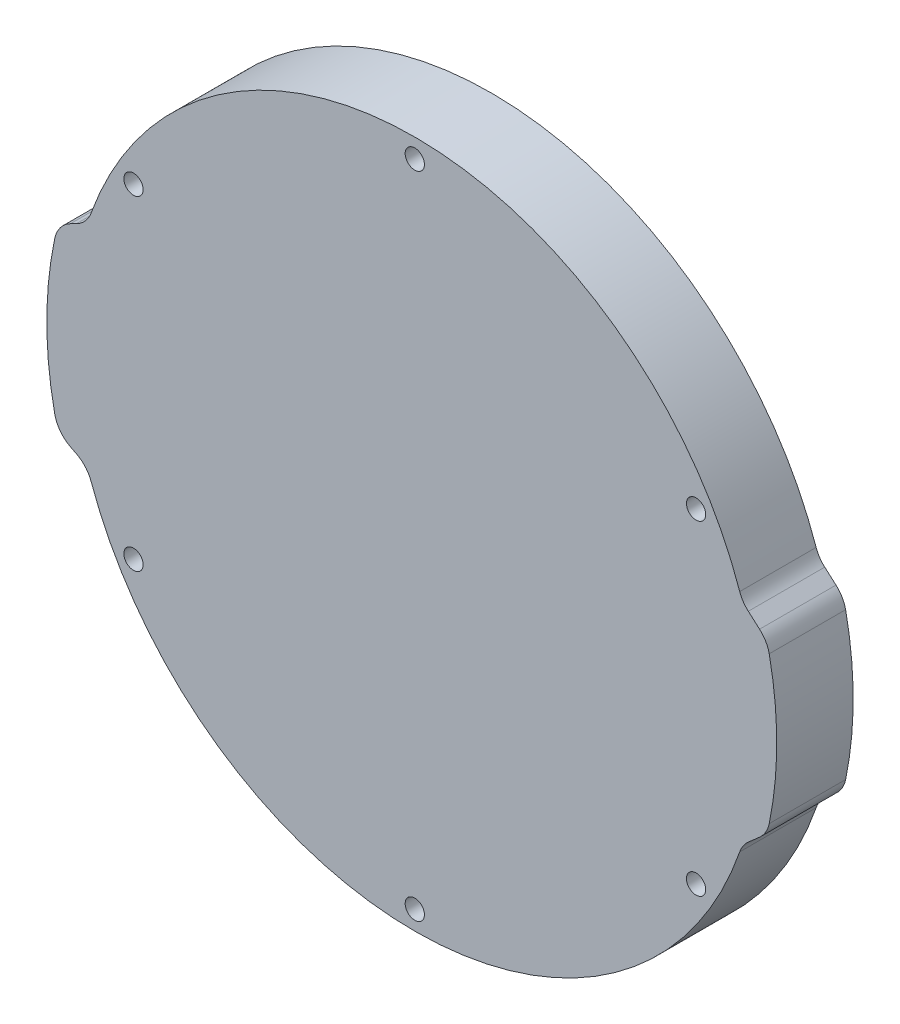
ISO-10303-21;
HEADER;
FILE_DESCRIPTION(('STEP AP214'),'2;1');
FILE_NAME('part.step','',(''),(''),'','','');
FILE_SCHEMA(('AUTOMOTIVE_DESIGN { 1 0 10303 214 1 1 1 1 }'));
ENDSEC;
DATA;
#1=APPLICATION_CONTEXT('core data for automotive mechanical design processes');
#2=APPLICATION_PROTOCOL_DEFINITION('international standard','automotive_design',2000,#1);
#3=PRODUCT_CONTEXT('',#1,'mechanical');
#4=PRODUCT('Part','Part','',(#3));
#5=PRODUCT_RELATED_PRODUCT_CATEGORY('part','',(#4));
#6=PRODUCT_DEFINITION_FORMATION('','',#4);
#7=PRODUCT_DEFINITION_CONTEXT('part definition',#1,'design');
#8=PRODUCT_DEFINITION('design','',#6,#7);
#9=PRODUCT_DEFINITION_SHAPE('','',#8);
#10=(LENGTH_UNIT() NAMED_UNIT(*) SI_UNIT(.MILLI.,.METRE.));
#11=(NAMED_UNIT(*) PLANE_ANGLE_UNIT() SI_UNIT($,.RADIAN.));
#12=(NAMED_UNIT(*) SI_UNIT($,.STERADIAN.) SOLID_ANGLE_UNIT());
#13=UNCERTAINTY_MEASURE_WITH_UNIT(LENGTH_MEASURE(1.E-05),#10,'distance_accuracy_value','');
#14=(GEOMETRIC_REPRESENTATION_CONTEXT(3) GLOBAL_UNCERTAINTY_ASSIGNED_CONTEXT((#13)) GLOBAL_UNIT_ASSIGNED_CONTEXT((#10,
#11,#12)) REPRESENTATION_CONTEXT('',''));
#15=CARTESIAN_POINT('',(0.,0.,0.));
#16=DIRECTION('',(0.,0.,1.));
#17=DIRECTION('',(1.,0.,0.));
#18=AXIS2_PLACEMENT_3D('',#15,#16,#17);
#19=CARTESIAN_POINT('',(0.,0.,12.7));
#20=DIRECTION('',(0.,0.,-1.));
#21=DIRECTION('',(-1.,0.,0.));
#22=AXIS2_PLACEMENT_3D('',#19,#20,#21);
#23=PLANE('',#22);
#24=CARTESIAN_POINT('',(5.42327943909187E-12,-53.975,12.7));
#25=DIRECTION('',(0.,0.,1.));
#26=DIRECTION('',(1.,0.,0.));
#27=AXIS2_PLACEMENT_3D('',#24,#25,#26);
#28=CIRCLE('',#27,1.6);
#29=CARTESIAN_POINT('',(1.60000000000542,-53.975,12.7));
#30=VERTEX_POINT('',#29);
#31=EDGE_CURVE('E554',#30,#30,#28,.T.);
#32=ORIENTED_EDGE('',*,*,#31,.F.);
#33=EDGE_LOOP('',(#32));
#34=FACE_BOUND('',#33,.T.);
#35=CARTESIAN_POINT('',(46.7437211692664,26.9875000000024,12.7));
#36=DIRECTION('',(0.,0.,1.));
#37=DIRECTION('',(1.,0.,0.));
#38=AXIS2_PLACEMENT_3D('',#35,#36,#37);
#39=CIRCLE('',#38,1.6);
#40=CARTESIAN_POINT('',(48.3437211692664,26.9875000000024,12.7));
#41=VERTEX_POINT('',#40);
#42=EDGE_CURVE('E566',#41,#41,#39,.T.);
#43=ORIENTED_EDGE('',*,*,#42,.F.);
#44=EDGE_LOOP('',(#43));
#45=FACE_BOUND('',#44,.T.);
#46=CARTESIAN_POINT('',(0.,53.975,12.7));
#47=DIRECTION('',(0.,0.,1.));
#48=DIRECTION('',(1.,0.,0.));
#49=AXIS2_PLACEMENT_3D('',#46,#47,#48);
#50=CIRCLE('',#49,1.6);
#51=CARTESIAN_POINT('',(1.6,53.975,12.7));
#52=VERTEX_POINT('',#51);
#53=EDGE_CURVE('E304',#52,#52,#50,.T.);
#54=ORIENTED_EDGE('',*,*,#53,.F.);
#55=EDGE_LOOP('',(#54));
#56=FACE_BOUND('',#55,.T.);
#57=CARTESIAN_POINT('',(0.,0.,12.7));
#58=DIRECTION('',(0.,0.,1.));
#59=DIRECTION('',(-1.,0.,0.));
#60=AXIS2_PLACEMENT_3D('',#57,#58,#59);
#61=CIRCLE('',#60,60.15);
#62=CARTESIAN_POINT('',(58.8955000502554,-12.2205799301985,12.7));
#63=VERTEX_POINT('',#62);
#64=CARTESIAN_POINT('',(58.8955000502554,12.2205799301985,12.7));
#65=VERTEX_POINT('',#64);
#66=EDGE_CURVE('E193',#63,#65,#61,.T.);
#67=ORIENTED_EDGE('',*,*,#66,.T.);
#68=CARTESIAN_POINT('',(53.9997810103339,11.2047378744879,12.7));
#69=DIRECTION('',(0.,0.,-1.));
#70=DIRECTION('',(-1.,0.,0.));
#71=AXIS2_PLACEMENT_3D('',#68,#69,#70);
#72=CIRCLE('',#71,5.);
#73=CARTESIAN_POINT('',(57.2965267788144,14.9639222724665,12.7));
#74=VERTEX_POINT('',#73);
#75=EDGE_CURVE('E218',#65,#74,#72,.F.);
#76=ORIENTED_EDGE('',*,*,#75,.T.);
#77=DIRECTION('',(-0.751836879595718,0.659349153696108,0.));
#78=VECTOR('',#77,1.);
#79=CARTESIAN_POINT('',(58.5251082507886,13.8864755871849,12.7));
#80=LINE('',#79,#78);
#81=CARTESIAN_POINT('',(55.4209620757174,16.6087631059652,12.7));
#82=VERTEX_POINT('',#81);
#83=EDGE_CURVE('E295',#74,#82,#80,.T.);
#84=ORIENTED_EDGE('',*,*,#83,.T.);
#85=CARTESIAN_POINT('',(58.717707844198,20.3679475039438,12.7));
#86=DIRECTION('',(0.,0.,-1.));
#87=DIRECTION('',(-1.,0.,0.));
#88=AXIS2_PLACEMENT_3D('',#85,#86,#87);
#89=CIRCLE('',#88,5.);
#90=CARTESIAN_POINT('',(53.9938375429753,18.7293354762733,12.7));
#91=VERTEX_POINT('',#90);
#92=EDGE_CURVE('E156',#82,#91,#89,.T.);
#93=ORIENTED_EDGE('',*,*,#92,.T.);
#94=CARTESIAN_POINT('',(0.,0.,12.7));
#95=DIRECTION('',(0.,0.,1.));
#96=DIRECTION('',(1.,0.,0.));
#97=AXIS2_PLACEMENT_3D('',#94,#95,#96);
#98=CIRCLE('',#97,57.15);
#99=CARTESIAN_POINT('',(-53.7797573620192,19.3354647754415,12.7));
#100=VERTEX_POINT('',#99);
#101=EDGE_CURVE('E166',#91,#100,#98,.T.);
#102=ORIENTED_EDGE('',*,*,#101,.T.);
#103=CARTESIAN_POINT('',(-58.4848979886176,21.0271064880785,12.7));
#104=DIRECTION('',(0.,0.,-1.));
#105=DIRECTION('',(-1.,0.,0.));
#106=AXIS2_PLACEMENT_3D('',#103,#104,#105);
#107=CIRCLE('',#106,5.);
#108=CARTESIAN_POINT('',(-56.2040598152342,16.5776371683914,12.7));
#109=VERTEX_POINT('',#108);
#110=EDGE_CURVE('E11',#100,#109,#107,.T.);
#111=ORIENTED_EDGE('',*,*,#110,.T.);
#112=DIRECTION('',(-0.889893863937431,-0.456167634676671,0.));
#113=VECTOR('',#112,1.);
#114=CARTESIAN_POINT('',(-59.2817214662327,15.,12.7));
#115=LINE('',#114,#113);
#116=CARTESIAN_POINT('',(-57.2177499229321,16.0580104606875,12.7));
#117=VERTEX_POINT('',#116);
#118=EDGE_CURVE('E290',#109,#117,#115,.T.);
#119=ORIENTED_EDGE('',*,*,#118,.T.);
#120=CARTESIAN_POINT('',(-54.9369117495487,11.6085411410003,12.7));
#121=DIRECTION('',(0.,0.,-1.));
#122=DIRECTION('',(-1.,0.,0.));
#123=AXIS2_PLACEMENT_3D('',#120,#121,#122);
#124=CIRCLE('',#123,5.);
#125=CARTESIAN_POINT('',(-59.8288896435424,12.6422491678036,12.7));
#126=VERTEX_POINT('',#125);
#127=EDGE_CURVE('E212',#117,#126,#124,.F.);
#128=ORIENTED_EDGE('',*,*,#127,.T.);
#129=CARTESIAN_POINT('',(0.,0.,12.7));
#130=DIRECTION('',(0.,0.,1.));
#131=DIRECTION('',(1.,0.,0.));
#132=AXIS2_PLACEMENT_3D('',#129,#130,#131);
#133=CIRCLE('',#132,61.15);
#134=CARTESIAN_POINT('',(-59.8288896435424,-12.6422491678036,12.7));
#135=VERTEX_POINT('',#134);
#136=EDGE_CURVE('E281',#126,#135,#133,.T.);
#137=ORIENTED_EDGE('',*,*,#136,.T.);
#138=CARTESIAN_POINT('',(-54.9369117495487,-11.6085411410003,12.7));
#139=DIRECTION('',(0.,0.,-1.));
#140=DIRECTION('',(-1.,0.,0.));
#141=AXIS2_PLACEMENT_3D('',#138,#139,#140);
#142=CIRCLE('',#141,5.);
#143=CARTESIAN_POINT('',(-57.2177499229321,-16.0580104606875,12.7));
#144=VERTEX_POINT('',#143);
#145=EDGE_CURVE('E214',#135,#144,#142,.F.);
#146=ORIENTED_EDGE('',*,*,#145,.T.);
#147=DIRECTION('',(0.889893863937431,-0.456167634676671,0.));
#148=VECTOR('',#147,1.);
#149=CARTESIAN_POINT('',(-59.2817214662327,-15.,12.7));
#150=LINE('',#149,#148);
#151=CARTESIAN_POINT('',(-56.2040598152342,-16.5776371683914,12.7));
#152=VERTEX_POINT('',#151);
#153=EDGE_CURVE('E257',#144,#152,#150,.T.);
#154=ORIENTED_EDGE('',*,*,#153,.T.);
#155=CARTESIAN_POINT('',(-58.4848979886176,-21.0271064880785,12.7));
#156=DIRECTION('',(0.,0.,-1.));
#157=DIRECTION('',(-1.,0.,0.));
#158=AXIS2_PLACEMENT_3D('',#155,#156,#157);
#159=CIRCLE('',#158,5.);
#160=CARTESIAN_POINT('',(-53.7797573620192,-19.3354647754415,12.7));
#161=VERTEX_POINT('',#160);
#162=EDGE_CURVE('E249',#152,#161,#159,.T.);
#163=ORIENTED_EDGE('',*,*,#162,.T.);
#164=CARTESIAN_POINT('',(0.,0.,12.7));
#165=DIRECTION('',(0.,0.,1.));
#166=DIRECTION('',(1.,0.,0.));
#167=AXIS2_PLACEMENT_3D('',#164,#165,#166);
#168=CIRCLE('',#167,57.15);
#169=CARTESIAN_POINT('',(53.9938375429753,-18.7293354762733,12.7));
#170=VERTEX_POINT('',#169);
#171=EDGE_CURVE('E255',#161,#170,#168,.T.);
#172=ORIENTED_EDGE('',*,*,#171,.T.);
#173=CARTESIAN_POINT('',(58.717707844198,-20.3679475039438,12.7));
#174=DIRECTION('',(0.,0.,-1.));
#175=DIRECTION('',(-1.,0.,0.));
#176=AXIS2_PLACEMENT_3D('',#173,#174,#175);
#177=CIRCLE('',#176,5.);
#178=CARTESIAN_POINT('',(55.4209620757174,-16.6087631059652,12.7));
#179=VERTEX_POINT('',#178);
#180=EDGE_CURVE('E54',#170,#179,#177,.T.);
#181=ORIENTED_EDGE('',*,*,#180,.T.);
#182=DIRECTION('',(0.751836879595718,0.659349153696108,0.));
#183=VECTOR('',#182,1.);
#184=CARTESIAN_POINT('',(58.5251082507886,-13.8864755871849,12.7));
#185=LINE('',#184,#183);
#186=CARTESIAN_POINT('',(57.2965267788144,-14.9639222724665,12.7));
#187=VERTEX_POINT('',#186);
#188=EDGE_CURVE('E194',#179,#187,#185,.T.);
#189=ORIENTED_EDGE('',*,*,#188,.T.);
#190=CARTESIAN_POINT('',(53.9997810103339,-11.2047378744879,12.7));
#191=DIRECTION('',(0.,0.,-1.));
#192=DIRECTION('',(-1.,0.,0.));
#193=AXIS2_PLACEMENT_3D('',#190,#191,#192);
#194=CIRCLE('',#193,5.);
#195=EDGE_CURVE('E216',#187,#63,#194,.F.);
#196=ORIENTED_EDGE('',*,*,#195,.T.);
#197=EDGE_LOOP('',(#67,#76,#84,#93,#102,#111,#119,#128,#137,#146,#154,#163,#172,#181,#189,#196));
#198=FACE_BOUND('',#197,.T.);
#199=CARTESIAN_POINT('',(-46.743721169261,-26.9875000000024,12.7));
#200=DIRECTION('',(0.,0.,1.));
#201=DIRECTION('',(1.,0.,0.));
#202=AXIS2_PLACEMENT_3D('',#199,#200,#201);
#203=CIRCLE('',#202,1.6);
#204=CARTESIAN_POINT('',(-45.143721169261,-26.9875000000024,12.7));
#205=VERTEX_POINT('',#204);
#206=EDGE_CURVE('E314',#205,#205,#203,.T.);
#207=ORIENTED_EDGE('',*,*,#206,.F.);
#208=EDGE_LOOP('',(#207));
#209=FACE_BOUND('',#208,.T.);
#210=CARTESIAN_POINT('',(46.7437211692692,-26.9874999999976,12.7));
#211=DIRECTION('',(0.,0.,1.));
#212=DIRECTION('',(1.,0.,0.));
#213=AXIS2_PLACEMENT_3D('',#210,#211,#212);
#214=CIRCLE('',#213,1.6);
#215=CARTESIAN_POINT('',(48.3437211692691,-26.9874999999976,12.7));
#216=VERTEX_POINT('',#215);
#217=EDGE_CURVE('E560',#216,#216,#214,.T.);
#218=ORIENTED_EDGE('',*,*,#217,.F.);
#219=EDGE_LOOP('',(#218));
#220=FACE_BOUND('',#219,.T.);
#221=CARTESIAN_POINT('',(-46.7437211692637,26.9874999999976,12.7));
#222=DIRECTION('',(0.,0.,1.));
#223=DIRECTION('',(1.,0.,0.));
#224=AXIS2_PLACEMENT_3D('',#221,#222,#223);
#225=CIRCLE('',#224,1.6);
#226=CARTESIAN_POINT('',(-45.1437211692637,26.9874999999976,12.7));
#227=VERTEX_POINT('',#226);
#228=EDGE_CURVE('E545',#227,#227,#225,.T.);
#229=ORIENTED_EDGE('',*,*,#228,.F.);
#230=EDGE_LOOP('',(#229));
#231=FACE_BOUND('',#230,.T.);
#232=ADVANCED_FACE('F32',(#34,#45,#56,#198,#209,#220,#231),#23,.F.);
#233=CARTESIAN_POINT('',(0.,0.,0.));
#234=DIRECTION('',(0.,0.,-1.));
#235=DIRECTION('',(-1.,0.,0.));
#236=AXIS2_PLACEMENT_3D('',#233,#234,#235);
#237=PLANE('',#236);
#238=CARTESIAN_POINT('',(5.42327943909187E-12,-53.975,0.));
#239=DIRECTION('',(0.,0.,1.));
#240=DIRECTION('',(1.,0.,0.));
#241=AXIS2_PLACEMENT_3D('',#238,#239,#240);
#242=CIRCLE('',#241,1.6);
#243=CARTESIAN_POINT('',(1.60000000000542,-53.975,0.));
#244=VERTEX_POINT('',#243);
#245=EDGE_CURVE('E551',#244,#244,#242,.T.);
#246=ORIENTED_EDGE('',*,*,#245,.T.);
#247=EDGE_LOOP('',(#246));
#248=FACE_BOUND('',#247,.T.);
#249=CARTESIAN_POINT('',(46.7437211692664,26.9875000000024,0.));
#250=DIRECTION('',(0.,0.,1.));
#251=DIRECTION('',(1.,0.,0.));
#252=AXIS2_PLACEMENT_3D('',#249,#250,#251);
#253=CIRCLE('',#252,1.6);
#254=CARTESIAN_POINT('',(48.3437211692664,26.9875000000024,0.));
#255=VERTEX_POINT('',#254);
#256=EDGE_CURVE('E563',#255,#255,#253,.T.);
#257=ORIENTED_EDGE('',*,*,#256,.T.);
#258=EDGE_LOOP('',(#257));
#259=FACE_BOUND('',#258,.T.);
#260=CARTESIAN_POINT('',(0.,53.975,0.));
#261=DIRECTION('',(0.,0.,1.));
#262=DIRECTION('',(1.,0.,0.));
#263=AXIS2_PLACEMENT_3D('',#260,#261,#262);
#264=CIRCLE('',#263,1.6);
#265=CARTESIAN_POINT('',(1.6,53.975,0.));
#266=VERTEX_POINT('',#265);
#267=EDGE_CURVE('E309',#266,#266,#264,.T.);
#268=ORIENTED_EDGE('',*,*,#267,.T.);
#269=EDGE_LOOP('',(#268));
#270=FACE_BOUND('',#269,.T.);
#271=DIRECTION('',(-0.751836879595718,0.659349153696108,0.));
#272=VECTOR('',#271,1.);
#273=CARTESIAN_POINT('',(58.5251082507886,13.8864755871849,0.));
#274=LINE('',#273,#272);
#275=CARTESIAN_POINT('',(57.2965267788144,14.9639222724665,0.));
#276=VERTEX_POINT('',#275);
#277=CARTESIAN_POINT('',(55.4209620757174,16.6087631059652,0.));
#278=VERTEX_POINT('',#277);
#279=EDGE_CURVE('E174',#276,#278,#274,.T.);
#280=ORIENTED_EDGE('',*,*,#279,.F.);
#281=CARTESIAN_POINT('',(53.9997810103339,11.2047378744879,0.));
#282=DIRECTION('',(0.,0.,-1.));
#283=DIRECTION('',(-1.,0.,0.));
#284=AXIS2_PLACEMENT_3D('',#281,#282,#283);
#285=CIRCLE('',#284,5.);
#286=CARTESIAN_POINT('',(58.8955000502554,12.2205799301985,0.));
#287=VERTEX_POINT('',#286);
#288=EDGE_CURVE('E205',#276,#287,#285,.T.);
#289=ORIENTED_EDGE('',*,*,#288,.T.);
#290=CARTESIAN_POINT('',(0.,0.,0.));
#291=DIRECTION('',(0.,0.,1.));
#292=DIRECTION('',(-1.,0.,0.));
#293=AXIS2_PLACEMENT_3D('',#290,#291,#292);
#294=CIRCLE('',#293,60.15);
#295=CARTESIAN_POINT('',(58.8955000502554,-12.2205799301985,0.));
#296=VERTEX_POINT('',#295);
#297=EDGE_CURVE('E179',#296,#287,#294,.T.);
#298=ORIENTED_EDGE('',*,*,#297,.F.);
#299=CARTESIAN_POINT('',(53.9997810103339,-11.2047378744879,0.));
#300=DIRECTION('',(0.,0.,-1.));
#301=DIRECTION('',(-1.,0.,0.));
#302=AXIS2_PLACEMENT_3D('',#299,#300,#301);
#303=CIRCLE('',#302,5.);
#304=CARTESIAN_POINT('',(57.2965267788144,-14.9639222724665,0.));
#305=VERTEX_POINT('',#304);
#306=EDGE_CURVE('E203',#296,#305,#303,.T.);
#307=ORIENTED_EDGE('',*,*,#306,.T.);
#308=DIRECTION('',(0.751836879595718,0.659349153696108,0.));
#309=VECTOR('',#308,1.);
#310=CARTESIAN_POINT('',(58.5251082507886,-13.8864755871849,0.));
#311=LINE('',#310,#309);
#312=CARTESIAN_POINT('',(55.4209620757174,-16.6087631059652,0.));
#313=VERTEX_POINT('',#312);
#314=EDGE_CURVE('E191',#313,#305,#311,.T.);
#315=ORIENTED_EDGE('',*,*,#314,.F.);
#316=CARTESIAN_POINT('',(58.717707844198,-20.3679475039438,0.));
#317=DIRECTION('',(0.,0.,-1.));
#318=DIRECTION('',(-1.,0.,0.));
#319=AXIS2_PLACEMENT_3D('',#316,#317,#318);
#320=CIRCLE('',#319,5.);
#321=CARTESIAN_POINT('',(53.9938375429753,-18.7293354762733,0.));
#322=VERTEX_POINT('',#321);
#323=EDGE_CURVE('E244',#313,#322,#320,.F.);
#324=ORIENTED_EDGE('',*,*,#323,.T.);
#325=CARTESIAN_POINT('',(0.,0.,0.));
#326=DIRECTION('',(0.,0.,1.));
#327=DIRECTION('',(1.,0.,0.));
#328=AXIS2_PLACEMENT_3D('',#325,#326,#327);
#329=CIRCLE('',#328,57.15);
#330=CARTESIAN_POINT('',(-53.7797573620192,-19.3354647754415,0.));
#331=VERTEX_POINT('',#330);
#332=EDGE_CURVE('E188',#331,#322,#329,.T.);
#333=ORIENTED_EDGE('',*,*,#332,.F.);
#334=CARTESIAN_POINT('',(-58.4848979886176,-21.0271064880785,0.));
#335=DIRECTION('',(0.,0.,-1.));
#336=DIRECTION('',(-1.,0.,0.));
#337=AXIS2_PLACEMENT_3D('',#334,#335,#336);
#338=CIRCLE('',#337,5.);
#339=CARTESIAN_POINT('',(-56.2040598152342,-16.5776371683914,0.));
#340=VERTEX_POINT('',#339);
#341=EDGE_CURVE('E247',#331,#340,#338,.F.);
#342=ORIENTED_EDGE('',*,*,#341,.T.);
#343=DIRECTION('',(0.889893863937431,-0.456167634676671,0.));
#344=VECTOR('',#343,1.);
#345=CARTESIAN_POINT('',(-59.2817214662327,-15.,0.));
#346=LINE('',#345,#344);
#347=CARTESIAN_POINT('',(-57.2177499229321,-16.0580104606875,0.));
#348=VERTEX_POINT('',#347);
#349=EDGE_CURVE('E185',#348,#340,#346,.T.);
#350=ORIENTED_EDGE('',*,*,#349,.F.);
#351=CARTESIAN_POINT('',(-54.9369117495487,-11.6085411410003,0.));
#352=DIRECTION('',(0.,0.,-1.));
#353=DIRECTION('',(-1.,0.,0.));
#354=AXIS2_PLACEMENT_3D('',#351,#352,#353);
#355=CIRCLE('',#354,5.);
#356=CARTESIAN_POINT('',(-59.8288896435424,-12.6422491678036,0.));
#357=VERTEX_POINT('',#356);
#358=EDGE_CURVE('E201',#348,#357,#355,.T.);
#359=ORIENTED_EDGE('',*,*,#358,.T.);
#360=CARTESIAN_POINT('',(0.,0.,0.));
#361=DIRECTION('',(0.,0.,1.));
#362=DIRECTION('',(1.,0.,0.));
#363=AXIS2_PLACEMENT_3D('',#360,#361,#362);
#364=CIRCLE('',#363,61.15);
#365=CARTESIAN_POINT('',(-59.8288896435424,12.6422491678036,0.));
#366=VERTEX_POINT('',#365);
#367=EDGE_CURVE('E177',#366,#357,#364,.T.);
#368=ORIENTED_EDGE('',*,*,#367,.F.);
#369=CARTESIAN_POINT('',(-54.9369117495487,11.6085411410003,0.));
#370=DIRECTION('',(0.,0.,-1.));
#371=DIRECTION('',(-1.,0.,0.));
#372=AXIS2_PLACEMENT_3D('',#369,#370,#371);
#373=CIRCLE('',#372,5.);
#374=CARTESIAN_POINT('',(-57.2177499229321,16.0580104606875,0.));
#375=VERTEX_POINT('',#374);
#376=EDGE_CURVE('E199',#366,#375,#373,.T.);
#377=ORIENTED_EDGE('',*,*,#376,.T.);
#378=DIRECTION('',(-0.889893863937431,-0.456167634676671,0.));
#379=VECTOR('',#378,1.);
#380=CARTESIAN_POINT('',(-59.2817214662327,15.,0.));
#381=LINE('',#380,#379);
#382=CARTESIAN_POINT('',(-56.2040598152342,16.5776371683914,0.));
#383=VERTEX_POINT('',#382);
#384=EDGE_CURVE('E173',#383,#375,#381,.T.);
#385=ORIENTED_EDGE('',*,*,#384,.F.);
#386=CARTESIAN_POINT('',(-58.4848979886176,21.0271064880785,0.));
#387=DIRECTION('',(0.,0.,-1.));
#388=DIRECTION('',(-1.,0.,0.));
#389=AXIS2_PLACEMENT_3D('',#386,#387,#388);
#390=CIRCLE('',#389,5.);
#391=CARTESIAN_POINT('',(-53.7797573620192,19.3354647754415,0.));
#392=VERTEX_POINT('',#391);
#393=EDGE_CURVE('E40',#383,#392,#390,.F.);
#394=ORIENTED_EDGE('',*,*,#393,.T.);
#395=CARTESIAN_POINT('',(0.,0.,0.));
#396=DIRECTION('',(0.,0.,1.));
#397=DIRECTION('',(1.,0.,0.));
#398=AXIS2_PLACEMENT_3D('',#395,#396,#397);
#399=CIRCLE('',#398,57.15);
#400=CARTESIAN_POINT('',(53.9938375429753,18.7293354762733,0.));
#401=VERTEX_POINT('',#400);
#402=EDGE_CURVE('E163',#401,#392,#399,.T.);
#403=ORIENTED_EDGE('',*,*,#402,.F.);
#404=CARTESIAN_POINT('',(58.717707844198,20.3679475039438,0.));
#405=DIRECTION('',(0.,0.,-1.));
#406=DIRECTION('',(-1.,0.,0.));
#407=AXIS2_PLACEMENT_3D('',#404,#405,#406);
#408=CIRCLE('',#407,5.);
#409=EDGE_CURVE('E146',#401,#278,#408,.F.);
#410=ORIENTED_EDGE('',*,*,#409,.T.);
#411=EDGE_LOOP('',(#280,#289,#298,#307,#315,#324,#333,#342,#350,#359,#368,#377,#385,#394,#403,#410));
#412=FACE_BOUND('',#411,.T.);
#413=CARTESIAN_POINT('',(-46.743721169261,-26.9875000000024,0.));
#414=DIRECTION('',(0.,0.,1.));
#415=DIRECTION('',(1.,0.,0.));
#416=AXIS2_PLACEMENT_3D('',#413,#414,#415);
#417=CIRCLE('',#416,1.6);
#418=CARTESIAN_POINT('',(-45.143721169261,-26.9875000000024,0.));
#419=VERTEX_POINT('',#418);
#420=EDGE_CURVE('E317',#419,#419,#417,.T.);
#421=ORIENTED_EDGE('',*,*,#420,.T.);
#422=EDGE_LOOP('',(#421));
#423=FACE_BOUND('',#422,.T.);
#424=CARTESIAN_POINT('',(46.7437211692692,-26.9874999999976,0.));
#425=DIRECTION('',(0.,0.,1.));
#426=DIRECTION('',(1.,0.,0.));
#427=AXIS2_PLACEMENT_3D('',#424,#425,#426);
#428=CIRCLE('',#427,1.6);
#429=CARTESIAN_POINT('',(48.3437211692691,-26.9874999999976,0.));
#430=VERTEX_POINT('',#429);
#431=EDGE_CURVE('E557',#430,#430,#428,.T.);
#432=ORIENTED_EDGE('',*,*,#431,.T.);
#433=EDGE_LOOP('',(#432));
#434=FACE_BOUND('',#433,.T.);
#435=CARTESIAN_POINT('',(-46.7437211692637,26.9874999999976,0.));
#436=DIRECTION('',(0.,0.,1.));
#437=DIRECTION('',(1.,0.,0.));
#438=AXIS2_PLACEMENT_3D('',#435,#436,#437);
#439=CIRCLE('',#438,1.6);
#440=CARTESIAN_POINT('',(-45.1437211692637,26.9874999999976,0.));
#441=VERTEX_POINT('',#440);
#442=EDGE_CURVE('E548',#441,#441,#439,.T.);
#443=ORIENTED_EDGE('',*,*,#442,.T.);
#444=EDGE_LOOP('',(#443));
#445=FACE_BOUND('',#444,.T.);
#446=ADVANCED_FACE('F170',(#248,#259,#270,#412,#423,#434,#445),#237,.T.);
#447=CARTESIAN_POINT('',(0.,0.,12.7));
#448=DIRECTION('',(0.,0.,-1.));
#449=DIRECTION('',(-1.,0.,0.));
#450=AXIS2_PLACEMENT_3D('',#447,#448,#449);
#451=CYLINDRICAL_SURFACE('',#450,60.15);
#452=ORIENTED_EDGE('',*,*,#297,.T.);
#453=DIRECTION('',(0.,0.,-1.));
#454=VECTOR('',#453,1.);
#455=CARTESIAN_POINT('',(58.8955000502554,12.2205799301985,12.7));
#456=LINE('',#455,#454);
#457=EDGE_CURVE('E210',#287,#65,#456,.F.);
#458=ORIENTED_EDGE('',*,*,#457,.T.);
#459=ORIENTED_EDGE('',*,*,#66,.F.);
#460=DIRECTION('',(0.,0.,-1.));
#461=VECTOR('',#460,1.);
#462=CARTESIAN_POINT('',(58.8955000502554,-12.2205799301985,12.7));
#463=LINE('',#462,#461);
#464=EDGE_CURVE('E207',#63,#296,#463,.T.);
#465=ORIENTED_EDGE('',*,*,#464,.T.);
#466=EDGE_LOOP('',(#452,#458,#459,#465));
#467=FACE_BOUND('',#466,.T.);
#468=ADVANCED_FACE('F334',(#467),#451,.T.);
#469=CARTESIAN_POINT('',(58.5251082507886,13.8864755871849,12.7));
#470=DIRECTION('',(-0.659349153696108,-0.751836879595718,0.));
#471=DIRECTION('',(0.751836879595718,-0.659349153696108,0.));
#472=AXIS2_PLACEMENT_3D('',#469,#470,#471);
#473=PLANE('',#472);
#474=ORIENTED_EDGE('',*,*,#279,.T.);
#475=DIRECTION('',(0.,0.,1.));
#476=VECTOR('',#475,1.);
#477=CARTESIAN_POINT('',(55.4209620757174,16.6087631059652,12.7));
#478=LINE('',#477,#476);
#479=EDGE_CURVE('E151',#278,#82,#478,.T.);
#480=ORIENTED_EDGE('',*,*,#479,.T.);
#481=ORIENTED_EDGE('',*,*,#83,.F.);
#482=DIRECTION('',(0.,0.,-1.));
#483=VECTOR('',#482,1.);
#484=CARTESIAN_POINT('',(57.2965267788144,14.9639222724665,12.7));
#485=LINE('',#484,#483);
#486=EDGE_CURVE('E167',#74,#276,#485,.T.);
#487=ORIENTED_EDGE('',*,*,#486,.T.);
#488=EDGE_LOOP('',(#474,#480,#481,#487));
#489=FACE_BOUND('',#488,.T.);
#490=ADVANCED_FACE('F328',(#489),#473,.F.);
#491=CARTESIAN_POINT('',(0.,0.,12.7));
#492=DIRECTION('',(0.,0.,-1.));
#493=DIRECTION('',(-1.,0.,0.));
#494=AXIS2_PLACEMENT_3D('',#491,#492,#493);
#495=CYLINDRICAL_SURFACE('',#494,57.15);
#496=ORIENTED_EDGE('',*,*,#101,.F.);
#497=DIRECTION('',(0.,0.,-1.));
#498=VECTOR('',#497,1.);
#499=CARTESIAN_POINT('',(53.9938375429753,18.7293354762733,12.7));
#500=LINE('',#499,#498);
#501=EDGE_CURVE('E150',#91,#401,#500,.T.);
#502=ORIENTED_EDGE('',*,*,#501,.T.);
#503=ORIENTED_EDGE('',*,*,#402,.T.);
#504=DIRECTION('',(0.,0.,-1.));
#505=VECTOR('',#504,1.);
#506=CARTESIAN_POINT('',(-53.7797573620192,19.3354647754415,12.7));
#507=LINE('',#506,#505);
#508=EDGE_CURVE('E168',#392,#100,#507,.F.);
#509=ORIENTED_EDGE('',*,*,#508,.T.);
#510=EDGE_LOOP('',(#496,#502,#503,#509));
#511=FACE_BOUND('',#510,.T.);
#512=ADVANCED_FACE('F162',(#511),#495,.T.);
#513=CARTESIAN_POINT('',(-59.2817214662327,15.,12.7));
#514=DIRECTION('',(0.456167634676671,-0.889893863937431,0.));
#515=DIRECTION('',(0.889893863937431,0.456167634676671,0.));
#516=AXIS2_PLACEMENT_3D('',#513,#514,#515);
#517=PLANE('',#516);
#518=ORIENTED_EDGE('',*,*,#118,.F.);
#519=DIRECTION('',(0.,0.,1.));
#520=VECTOR('',#519,1.);
#521=CARTESIAN_POINT('',(-56.2040598152342,16.5776371683914,0.));
#522=LINE('',#521,#520);
#523=EDGE_CURVE('E157',#109,#383,#522,.F.);
#524=ORIENTED_EDGE('',*,*,#523,.T.);
#525=ORIENTED_EDGE('',*,*,#384,.T.);
#526=DIRECTION('',(0.,0.,-1.));
#527=VECTOR('',#526,1.);
#528=CARTESIAN_POINT('',(-57.2177499229321,16.0580104606875,12.7));
#529=LINE('',#528,#527);
#530=EDGE_CURVE('E239',#375,#117,#529,.F.);
#531=ORIENTED_EDGE('',*,*,#530,.T.);
#532=EDGE_LOOP('',(#518,#524,#525,#531));
#533=FACE_BOUND('',#532,.T.);
#534=ADVANCED_FACE('F287',(#533),#517,.F.);
#535=CARTESIAN_POINT('',(0.,0.,12.7));
#536=DIRECTION('',(0.,0.,-1.));
#537=DIRECTION('',(-1.,0.,0.));
#538=AXIS2_PLACEMENT_3D('',#535,#536,#537);
#539=CYLINDRICAL_SURFACE('',#538,61.15);
#540=ORIENTED_EDGE('',*,*,#367,.T.);
#541=DIRECTION('',(0.,0.,-1.));
#542=VECTOR('',#541,1.);
#543=CARTESIAN_POINT('',(-59.8288896435424,-12.6422491678036,12.7));
#544=LINE('',#543,#542);
#545=EDGE_CURVE('E237',#357,#135,#544,.F.);
#546=ORIENTED_EDGE('',*,*,#545,.T.);
#547=ORIENTED_EDGE('',*,*,#136,.F.);
#548=DIRECTION('',(0.,0.,-1.));
#549=VECTOR('',#548,1.);
#550=CARTESIAN_POINT('',(-59.8288896435424,12.6422491678036,12.7));
#551=LINE('',#550,#549);
#552=EDGE_CURVE('E234',#126,#366,#551,.T.);
#553=ORIENTED_EDGE('',*,*,#552,.T.);
#554=EDGE_LOOP('',(#540,#546,#547,#553));
#555=FACE_BOUND('',#554,.T.);
#556=ADVANCED_FACE('F277',(#555),#539,.T.);
#557=CARTESIAN_POINT('',(-59.2817214662327,-15.,12.7));
#558=DIRECTION('',(0.456167634676671,0.889893863937431,0.));
#559=DIRECTION('',(-0.889893863937431,0.456167634676671,0.));
#560=AXIS2_PLACEMENT_3D('',#557,#558,#559);
#561=PLANE('',#560);
#562=ORIENTED_EDGE('',*,*,#349,.T.);
#563=DIRECTION('',(0.,0.,1.));
#564=VECTOR('',#563,1.);
#565=CARTESIAN_POINT('',(-56.2040598152342,-16.5776371683914,12.7));
#566=LINE('',#565,#564);
#567=EDGE_CURVE('E232',#340,#152,#566,.T.);
#568=ORIENTED_EDGE('',*,*,#567,.T.);
#569=ORIENTED_EDGE('',*,*,#153,.F.);
#570=DIRECTION('',(0.,0.,-1.));
#571=VECTOR('',#570,1.);
#572=CARTESIAN_POINT('',(-57.2177499229321,-16.0580104606875,12.7));
#573=LINE('',#572,#571);
#574=EDGE_CURVE('E229',#144,#348,#573,.T.);
#575=ORIENTED_EDGE('',*,*,#574,.T.);
#576=EDGE_LOOP('',(#562,#568,#569,#575));
#577=FACE_BOUND('',#576,.T.);
#578=ADVANCED_FACE('F269',(#577),#561,.F.);
#579=CARTESIAN_POINT('',(0.,0.,12.7));
#580=DIRECTION('',(0.,0.,-1.));
#581=DIRECTION('',(-1.,0.,0.));
#582=AXIS2_PLACEMENT_3D('',#579,#580,#581);
#583=CYLINDRICAL_SURFACE('',#582,57.15);
#584=ORIENTED_EDGE('',*,*,#332,.T.);
#585=DIRECTION('',(0.,0.,-1.));
#586=VECTOR('',#585,1.);
#587=CARTESIAN_POINT('',(53.9938375429753,-18.7293354762733,12.7));
#588=LINE('',#587,#586);
#589=EDGE_CURVE('E227',#322,#170,#588,.F.);
#590=ORIENTED_EDGE('',*,*,#589,.T.);
#591=ORIENTED_EDGE('',*,*,#171,.F.);
#592=DIRECTION('',(0.,0.,-1.));
#593=VECTOR('',#592,1.);
#594=CARTESIAN_POINT('',(-53.7797573620192,-19.3354647754415,12.7));
#595=LINE('',#594,#593);
#596=EDGE_CURVE('E224',#161,#331,#595,.T.);
#597=ORIENTED_EDGE('',*,*,#596,.T.);
#598=EDGE_LOOP('',(#584,#590,#591,#597));
#599=FACE_BOUND('',#598,.T.);
#600=ADVANCED_FACE('F262',(#599),#583,.T.);
#601=CARTESIAN_POINT('',(58.5251082507886,-13.8864755871849,12.7));
#602=DIRECTION('',(-0.659349153696108,0.751836879595718,0.));
#603=DIRECTION('',(-0.751836879595718,-0.659349153696108,0.));
#604=AXIS2_PLACEMENT_3D('',#601,#602,#603);
#605=PLANE('',#604);
#606=ORIENTED_EDGE('',*,*,#314,.T.);
#607=DIRECTION('',(0.,0.,-1.));
#608=VECTOR('',#607,1.);
#609=CARTESIAN_POINT('',(57.2965267788144,-14.9639222724665,12.7));
#610=LINE('',#609,#608);
#611=EDGE_CURVE('E47',#305,#187,#610,.F.);
#612=ORIENTED_EDGE('',*,*,#611,.T.);
#613=ORIENTED_EDGE('',*,*,#188,.F.);
#614=DIRECTION('',(0.,0.,1.));
#615=VECTOR('',#614,1.);
#616=CARTESIAN_POINT('',(55.4209620757174,-16.6087631059652,0.));
#617=LINE('',#616,#615);
#618=EDGE_CURVE('E220',#179,#313,#617,.F.);
#619=ORIENTED_EDGE('',*,*,#618,.T.);
#620=EDGE_LOOP('',(#606,#612,#613,#619));
#621=FACE_BOUND('',#620,.T.);
#622=ADVANCED_FACE('F331',(#621),#605,.F.);
#623=CARTESIAN_POINT('',(0.,53.975,12.7));
#624=DIRECTION('',(0.,0.,-1.));
#625=DIRECTION('',(-1.,0.,0.));
#626=AXIS2_PLACEMENT_3D('',#623,#624,#625);
#627=CYLINDRICAL_SURFACE('',#626,1.6);
#628=ORIENTED_EDGE('',*,*,#53,.T.);
#629=EDGE_LOOP('',(#628));
#630=FACE_BOUND('',#629,.T.);
#631=ORIENTED_EDGE('',*,*,#267,.F.);
#632=EDGE_LOOP('',(#631));
#633=FACE_BOUND('',#632,.T.);
#634=ADVANCED_FACE('F353',(#630,#633),#627,.F.);
#635=CARTESIAN_POINT('',(-46.743721169261,-26.9875000000024,12.7));
#636=DIRECTION('',(0.,0.,-1.));
#637=DIRECTION('',(-1.,0.,0.));
#638=AXIS2_PLACEMENT_3D('',#635,#636,#637);
#639=CYLINDRICAL_SURFACE('',#638,1.6);
#640=ORIENTED_EDGE('',*,*,#206,.T.);
#641=EDGE_LOOP('',(#640));
#642=FACE_BOUND('',#641,.T.);
#643=ORIENTED_EDGE('',*,*,#420,.F.);
#644=EDGE_LOOP('',(#643));
#645=FACE_BOUND('',#644,.T.);
#646=ADVANCED_FACE('F398',(#642,#645),#639,.F.);
#647=CARTESIAN_POINT('',(46.7437211692664,26.9875000000024,12.7));
#648=DIRECTION('',(0.,0.,-1.));
#649=DIRECTION('',(-1.,0.,0.));
#650=AXIS2_PLACEMENT_3D('',#647,#648,#649);
#651=CYLINDRICAL_SURFACE('',#650,1.6);
#652=ORIENTED_EDGE('',*,*,#42,.T.);
#653=EDGE_LOOP('',(#652));
#654=FACE_BOUND('',#653,.T.);
#655=ORIENTED_EDGE('',*,*,#256,.F.);
#656=EDGE_LOOP('',(#655));
#657=FACE_BOUND('',#656,.T.);
#658=ADVANCED_FACE('F404',(#654,#657),#651,.F.);
#659=CARTESIAN_POINT('',(46.7437211692692,-26.9874999999976,12.7));
#660=DIRECTION('',(0.,0.,-1.));
#661=DIRECTION('',(-1.,0.,0.));
#662=AXIS2_PLACEMENT_3D('',#659,#660,#661);
#663=CYLINDRICAL_SURFACE('',#662,1.6);
#664=ORIENTED_EDGE('',*,*,#217,.T.);
#665=EDGE_LOOP('',(#664));
#666=FACE_BOUND('',#665,.T.);
#667=ORIENTED_EDGE('',*,*,#431,.F.);
#668=EDGE_LOOP('',(#667));
#669=FACE_BOUND('',#668,.T.);
#670=ADVANCED_FACE('F411',(#666,#669),#663,.F.);
#671=CARTESIAN_POINT('',(5.42327943909187E-12,-53.975,12.7));
#672=DIRECTION('',(0.,0.,-1.));
#673=DIRECTION('',(-1.,0.,0.));
#674=AXIS2_PLACEMENT_3D('',#671,#672,#673);
#675=CYLINDRICAL_SURFACE('',#674,1.6);
#676=ORIENTED_EDGE('',*,*,#31,.T.);
#677=EDGE_LOOP('',(#676));
#678=FACE_BOUND('',#677,.T.);
#679=ORIENTED_EDGE('',*,*,#245,.F.);
#680=EDGE_LOOP('',(#679));
#681=FACE_BOUND('',#680,.T.);
#682=ADVANCED_FACE('F419',(#678,#681),#675,.F.);
#683=CARTESIAN_POINT('',(-46.7437211692637,26.9874999999976,12.7));
#684=DIRECTION('',(0.,0.,-1.));
#685=DIRECTION('',(-1.,0.,0.));
#686=AXIS2_PLACEMENT_3D('',#683,#684,#685);
#687=CYLINDRICAL_SURFACE('',#686,1.6);
#688=ORIENTED_EDGE('',*,*,#228,.T.);
#689=EDGE_LOOP('',(#688));
#690=FACE_BOUND('',#689,.T.);
#691=ORIENTED_EDGE('',*,*,#442,.F.);
#692=EDGE_LOOP('',(#691));
#693=FACE_BOUND('',#692,.T.);
#694=ADVANCED_FACE('F427',(#690,#693),#687,.F.);
#695=CARTESIAN_POINT('',(58.717707844198,20.3679475039438,12.7));
#696=DIRECTION('',(0.,0.,-1.));
#697=DIRECTION('',(-1.,0.,0.));
#698=AXIS2_PLACEMENT_3D('',#695,#696,#697);
#699=CYLINDRICAL_SURFACE('',#698,5.);
#700=ORIENTED_EDGE('',*,*,#92,.F.);
#701=ORIENTED_EDGE('',*,*,#479,.F.);
#702=ORIENTED_EDGE('',*,*,#409,.F.);
#703=ORIENTED_EDGE('',*,*,#501,.F.);
#704=EDGE_LOOP('',(#700,#701,#702,#703));
#705=FACE_BOUND('',#704,.T.);
#706=ADVANCED_FACE('F149',(#705),#699,.F.);
#707=CARTESIAN_POINT('',(53.9997810103339,11.2047378744879,12.7));
#708=DIRECTION('',(0.,0.,-1.));
#709=DIRECTION('',(-1.,0.,0.));
#710=AXIS2_PLACEMENT_3D('',#707,#708,#709);
#711=CYLINDRICAL_SURFACE('',#710,5.);
#712=ORIENTED_EDGE('',*,*,#75,.F.);
#713=ORIENTED_EDGE('',*,*,#457,.F.);
#714=ORIENTED_EDGE('',*,*,#288,.F.);
#715=ORIENTED_EDGE('',*,*,#486,.F.);
#716=EDGE_LOOP('',(#712,#713,#714,#715));
#717=FACE_BOUND('',#716,.T.);
#718=ADVANCED_FACE('F326',(#717),#711,.T.);
#719=CARTESIAN_POINT('',(53.9997810103339,-11.2047378744879,12.7));
#720=DIRECTION('',(0.,0.,-1.));
#721=DIRECTION('',(-1.,0.,0.));
#722=AXIS2_PLACEMENT_3D('',#719,#720,#721);
#723=CYLINDRICAL_SURFACE('',#722,5.);
#724=ORIENTED_EDGE('',*,*,#195,.F.);
#725=ORIENTED_EDGE('',*,*,#611,.F.);
#726=ORIENTED_EDGE('',*,*,#306,.F.);
#727=ORIENTED_EDGE('',*,*,#464,.F.);
#728=EDGE_LOOP('',(#724,#725,#726,#727));
#729=FACE_BOUND('',#728,.T.);
#730=ADVANCED_FACE('F333',(#729),#723,.T.);
#731=CARTESIAN_POINT('',(58.717707844198,-20.3679475039438,12.7));
#732=DIRECTION('',(0.,0.,-1.));
#733=DIRECTION('',(-1.,0.,0.));
#734=AXIS2_PLACEMENT_3D('',#731,#732,#733);
#735=CYLINDRICAL_SURFACE('',#734,5.);
#736=ORIENTED_EDGE('',*,*,#180,.F.);
#737=ORIENTED_EDGE('',*,*,#589,.F.);
#738=ORIENTED_EDGE('',*,*,#323,.F.);
#739=ORIENTED_EDGE('',*,*,#618,.F.);
#740=EDGE_LOOP('',(#736,#737,#738,#739));
#741=FACE_BOUND('',#740,.T.);
#742=ADVANCED_FACE('F452',(#741),#735,.F.);
#743=CARTESIAN_POINT('',(-58.4848979886176,-21.0271064880785,12.7));
#744=DIRECTION('',(0.,0.,-1.));
#745=DIRECTION('',(-1.,0.,0.));
#746=AXIS2_PLACEMENT_3D('',#743,#744,#745);
#747=CYLINDRICAL_SURFACE('',#746,5.);
#748=ORIENTED_EDGE('',*,*,#162,.F.);
#749=ORIENTED_EDGE('',*,*,#567,.F.);
#750=ORIENTED_EDGE('',*,*,#341,.F.);
#751=ORIENTED_EDGE('',*,*,#596,.F.);
#752=EDGE_LOOP('',(#748,#749,#750,#751));
#753=FACE_BOUND('',#752,.T.);
#754=ADVANCED_FACE('F266',(#753),#747,.F.);
#755=CARTESIAN_POINT('',(-54.9369117495487,-11.6085411410003,12.7));
#756=DIRECTION('',(0.,0.,-1.));
#757=DIRECTION('',(-1.,0.,0.));
#758=AXIS2_PLACEMENT_3D('',#755,#756,#757);
#759=CYLINDRICAL_SURFACE('',#758,5.);
#760=ORIENTED_EDGE('',*,*,#145,.F.);
#761=ORIENTED_EDGE('',*,*,#545,.F.);
#762=ORIENTED_EDGE('',*,*,#358,.F.);
#763=ORIENTED_EDGE('',*,*,#574,.F.);
#764=EDGE_LOOP('',(#760,#761,#762,#763));
#765=FACE_BOUND('',#764,.T.);
#766=ADVANCED_FACE('F273',(#765),#759,.T.);
#767=CARTESIAN_POINT('',(-58.4848979886176,21.0271064880785,12.7));
#768=DIRECTION('',(0.,0.,-1.));
#769=DIRECTION('',(-1.,0.,0.));
#770=AXIS2_PLACEMENT_3D('',#767,#768,#769);
#771=CYLINDRICAL_SURFACE('',#770,5.);
#772=ORIENTED_EDGE('',*,*,#110,.F.);
#773=ORIENTED_EDGE('',*,*,#508,.F.);
#774=ORIENTED_EDGE('',*,*,#393,.F.);
#775=ORIENTED_EDGE('',*,*,#523,.F.);
#776=EDGE_LOOP('',(#772,#773,#774,#775));
#777=FACE_BOUND('',#776,.T.);
#778=ADVANCED_FACE('F293',(#777),#771,.F.);
#779=CARTESIAN_POINT('',(-54.9369117495487,11.6085411410003,12.7));
#780=DIRECTION('',(0.,0.,-1.));
#781=DIRECTION('',(-1.,0.,0.));
#782=AXIS2_PLACEMENT_3D('',#779,#780,#781);
#783=CYLINDRICAL_SURFACE('',#782,5.);
#784=ORIENTED_EDGE('',*,*,#127,.F.);
#785=ORIENTED_EDGE('',*,*,#530,.F.);
#786=ORIENTED_EDGE('',*,*,#376,.F.);
#787=ORIENTED_EDGE('',*,*,#552,.F.);
#788=EDGE_LOOP('',(#784,#785,#786,#787));
#789=FACE_BOUND('',#788,.T.);
#790=ADVANCED_FACE('F34',(#789),#783,.T.);
#791=CLOSED_SHELL('',(#232,#446,#468,#490,#512,#534,#556,#578,#600,#622,#634,#646,#658,#670,
#682,#694,#706,#718,#730,#742,#754,#766,#778,#790));
#792=MANIFOLD_SOLID_BREP('B2',#791);
#793=ADVANCED_BREP_SHAPE_REPRESENTATION('',(#18,#792),#14);
#794=SHAPE_DEFINITION_REPRESENTATION(#9,#793);
ENDSEC;
END-ISO-10303-21;
